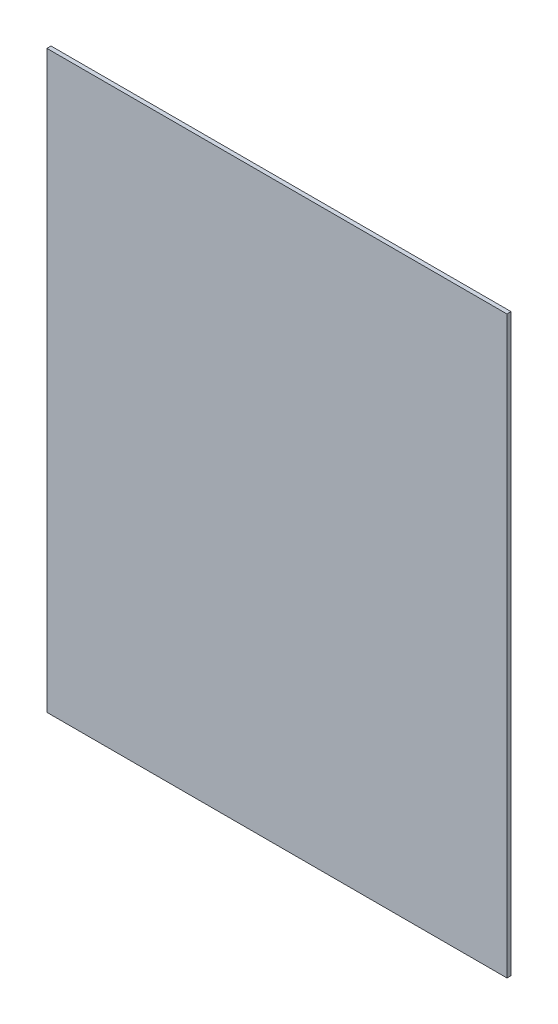
ISO-10303-21;
HEADER;
FILE_DESCRIPTION(('STEP AP214'),'2;1');
FILE_NAME('part.step','',(''),(''),'','','');
FILE_SCHEMA(('AUTOMOTIVE_DESIGN { 1 0 10303 214 1 1 1 1 }'));
ENDSEC;
DATA;
#1=APPLICATION_CONTEXT('core data for automotive mechanical design processes');
#2=APPLICATION_PROTOCOL_DEFINITION('international standard','automotive_design',2000,#1);
#3=PRODUCT_CONTEXT('',#1,'mechanical');
#4=PRODUCT('Part','Part','',(#3));
#5=PRODUCT_RELATED_PRODUCT_CATEGORY('part','',(#4));
#6=PRODUCT_DEFINITION_FORMATION('','',#4);
#7=PRODUCT_DEFINITION_CONTEXT('part definition',#1,'design');
#8=PRODUCT_DEFINITION('design','',#6,#7);
#9=PRODUCT_DEFINITION_SHAPE('','',#8);
#10=(LENGTH_UNIT() NAMED_UNIT(*) SI_UNIT(.MILLI.,.METRE.));
#11=(NAMED_UNIT(*) PLANE_ANGLE_UNIT() SI_UNIT($,.RADIAN.));
#12=(NAMED_UNIT(*) SI_UNIT($,.STERADIAN.) SOLID_ANGLE_UNIT());
#13=UNCERTAINTY_MEASURE_WITH_UNIT(LENGTH_MEASURE(1.E-05),#10,'distance_accuracy_value','');
#14=(GEOMETRIC_REPRESENTATION_CONTEXT(3) GLOBAL_UNCERTAINTY_ASSIGNED_CONTEXT((#13)) GLOBAL_UNIT_ASSIGNED_CONTEXT((#10,
#11,#12)) REPRESENTATION_CONTEXT('',''));
#15=CARTESIAN_POINT('',(0.,0.,0.));
#16=DIRECTION('',(0.,0.,1.));
#17=DIRECTION('',(1.,0.,0.));
#18=AXIS2_PLACEMENT_3D('',#15,#16,#17);
#19=CARTESIAN_POINT('',(0.,68.,-2.8421709430404E-13));
#20=DIRECTION('',(0.,0.,1.));
#21=DIRECTION('',(1.,0.,0.));
#22=AXIS2_PLACEMENT_3D('',#19,#20,#21);
#23=PLANE('',#22);
#24=DIRECTION('',(0.,1.,0.));
#25=VECTOR('',#24,1.);
#26=CARTESIAN_POINT('',(-275.,243.,-2.8421709430404E-13));
#27=LINE('',#26,#25);
#28=CARTESIAN_POINT('',(-275.,-282.,-2.8421709430404E-13));
#29=VERTEX_POINT('',#28);
#30=CARTESIAN_POINT('',(-275.,418.,-2.8421709430404E-13));
#31=VERTEX_POINT('',#30);
#32=EDGE_CURVE('E11',#29,#31,#27,.T.);
#33=ORIENTED_EDGE('',*,*,#32,.T.);
#34=DIRECTION('',(-1.,0.,0.));
#35=VECTOR('',#34,1.);
#36=CARTESIAN_POINT('',(285.,418.,-2.8421709430404E-13));
#37=LINE('',#36,#35);
#38=CARTESIAN_POINT('',(285.,418.,-2.8421709430404E-13));
#39=VERTEX_POINT('',#38);
#40=EDGE_CURVE('E24',#39,#31,#37,.T.);
#41=ORIENTED_EDGE('',*,*,#40,.F.);
#42=DIRECTION('',(0.,1.,0.));
#43=VECTOR('',#42,1.);
#44=CARTESIAN_POINT('',(285.,-282.,-2.8421709430404E-13));
#45=LINE('',#44,#43);
#46=CARTESIAN_POINT('',(285.,-282.,-2.8421709430404E-13));
#47=VERTEX_POINT('',#46);
#48=EDGE_CURVE('E100',#47,#39,#45,.T.);
#49=ORIENTED_EDGE('',*,*,#48,.F.);
#50=DIRECTION('',(1.,0.,0.));
#51=VECTOR('',#50,1.);
#52=CARTESIAN_POINT('',(-285.,-282.,-2.8421709430404E-13));
#53=LINE('',#52,#51);
#54=EDGE_CURVE('E96',#29,#47,#53,.T.);
#55=ORIENTED_EDGE('',*,*,#54,.F.);
#56=EDGE_LOOP('',(#33,#41,#49,#55));
#57=FACE_BOUND('',#56,.T.);
#58=ADVANCED_FACE('F16',(#57),#23,.F.);
#59=CARTESIAN_POINT('',(285.,-282.,-2.8421709430404E-13));
#60=DIRECTION('',(1.,0.,0.));
#61=DIRECTION('',(0.,1.,0.));
#62=AXIS2_PLACEMENT_3D('',#59,#60,#61);
#63=PLANE('',#62);
#64=ORIENTED_EDGE('',*,*,#48,.T.);
#65=DIRECTION('',(0.,0.,1.));
#66=VECTOR('',#65,1.);
#67=CARTESIAN_POINT('',(285.,418.,-2.8421709430404E-13));
#68=LINE('',#67,#66);
#69=CARTESIAN_POINT('',(285.,418.,4.99999999999972));
#70=VERTEX_POINT('',#69);
#71=EDGE_CURVE('E92',#39,#70,#68,.T.);
#72=ORIENTED_EDGE('',*,*,#71,.T.);
#73=DIRECTION('',(0.,1.,0.));
#74=VECTOR('',#73,1.);
#75=CARTESIAN_POINT('',(285.,-282.,4.99999999999972));
#76=LINE('',#75,#74);
#77=CARTESIAN_POINT('',(285.,-282.,4.99999999999972));
#78=VERTEX_POINT('',#77);
#79=EDGE_CURVE('E88',#78,#70,#76,.T.);
#80=ORIENTED_EDGE('',*,*,#79,.F.);
#81=DIRECTION('',(0.,0.,1.));
#82=VECTOR('',#81,1.);
#83=CARTESIAN_POINT('',(285.,-282.,-2.8421709430404E-13));
#84=LINE('',#83,#82);
#85=EDGE_CURVE('E60',#47,#78,#84,.T.);
#86=ORIENTED_EDGE('',*,*,#85,.F.);
#87=EDGE_LOOP('',(#64,#72,#80,#86));
#88=FACE_BOUND('',#87,.T.);
#89=ADVANCED_FACE('F112',(#88),#63,.T.);
#90=CARTESIAN_POINT('',(285.,418.,-2.8421709430404E-13));
#91=DIRECTION('',(0.,1.,0.));
#92=DIRECTION('',(-1.,0.,0.));
#93=AXIS2_PLACEMENT_3D('',#90,#91,#92);
#94=PLANE('',#93);
#95=DIRECTION('',(0.,0.,1.));
#96=VECTOR('',#95,1.);
#97=CARTESIAN_POINT('',(-275.,418.,-2.8421709430404E-13));
#98=LINE('',#97,#96);
#99=CARTESIAN_POINT('',(-275.,418.,4.99999999999972));
#100=VERTEX_POINT('',#99);
#101=EDGE_CURVE('E75',#31,#100,#98,.T.);
#102=ORIENTED_EDGE('',*,*,#101,.T.);
#103=DIRECTION('',(-1.,0.,0.));
#104=VECTOR('',#103,1.);
#105=CARTESIAN_POINT('',(285.,418.,4.99999999999972));
#106=LINE('',#105,#104);
#107=EDGE_CURVE('E69',#70,#100,#106,.T.);
#108=ORIENTED_EDGE('',*,*,#107,.F.);
#109=ORIENTED_EDGE('',*,*,#71,.F.);
#110=ORIENTED_EDGE('',*,*,#40,.T.);
#111=EDGE_LOOP('',(#102,#108,#109,#110));
#112=FACE_BOUND('',#111,.T.);
#113=ADVANCED_FACE('F110',(#112),#94,.T.);
#114=CARTESIAN_POINT('',(-285.,-282.,-2.8421709430404E-13));
#115=DIRECTION('',(0.,-1.,0.));
#116=DIRECTION('',(1.,0.,0.));
#117=AXIS2_PLACEMENT_3D('',#114,#115,#116);
#118=PLANE('',#117);
#119=DIRECTION('',(0.,0.,-1.));
#120=VECTOR('',#119,1.);
#121=CARTESIAN_POINT('',(-275.,-282.,-2.8421709430404E-13));
#122=LINE('',#121,#120);
#123=CARTESIAN_POINT('',(-275.,-282.,4.99999999999972));
#124=VERTEX_POINT('',#123);
#125=EDGE_CURVE('E58',#124,#29,#122,.T.);
#126=ORIENTED_EDGE('',*,*,#125,.T.);
#127=ORIENTED_EDGE('',*,*,#54,.T.);
#128=ORIENTED_EDGE('',*,*,#85,.T.);
#129=DIRECTION('',(1.,0.,0.));
#130=VECTOR('',#129,1.);
#131=CARTESIAN_POINT('',(-285.,-282.,4.99999999999972));
#132=LINE('',#131,#130);
#133=EDGE_CURVE('E53',#124,#78,#132,.T.);
#134=ORIENTED_EDGE('',*,*,#133,.F.);
#135=EDGE_LOOP('',(#126,#127,#128,#134));
#136=FACE_BOUND('',#135,.T.);
#137=ADVANCED_FACE('F55',(#136),#118,.T.);
#138=CARTESIAN_POINT('',(0.,68.,4.99999999999972));
#139=DIRECTION('',(0.,0.,1.));
#140=DIRECTION('',(1.,0.,0.));
#141=AXIS2_PLACEMENT_3D('',#138,#139,#140);
#142=PLANE('',#141);
#143=DIRECTION('',(0.,-1.,0.));
#144=VECTOR('',#143,1.);
#145=CARTESIAN_POINT('',(-275.,243.,4.99999999999972));
#146=LINE('',#145,#144);
#147=EDGE_CURVE('E63',#100,#124,#146,.T.);
#148=ORIENTED_EDGE('',*,*,#147,.T.);
#149=ORIENTED_EDGE('',*,*,#133,.T.);
#150=ORIENTED_EDGE('',*,*,#79,.T.);
#151=ORIENTED_EDGE('',*,*,#107,.T.);
#152=EDGE_LOOP('',(#148,#149,#150,#151));
#153=FACE_BOUND('',#152,.T.);
#154=ADVANCED_FACE('F67',(#153),#142,.T.);
#155=CARTESIAN_POINT('',(-275.,418.,-2.8421709430404E-13));
#156=DIRECTION('',(1.,0.,0.));
#157=DIRECTION('',(0.,0.,-1.));
#158=AXIS2_PLACEMENT_3D('',#155,#156,#157);
#159=PLANE('',#158);
#160=ORIENTED_EDGE('',*,*,#32,.F.);
#161=ORIENTED_EDGE('',*,*,#125,.F.);
#162=ORIENTED_EDGE('',*,*,#147,.F.);
#163=ORIENTED_EDGE('',*,*,#101,.F.);
#164=EDGE_LOOP('',(#160,#161,#162,#163));
#165=FACE_BOUND('',#164,.T.);
#166=ADVANCED_FACE('F73',(#165),#159,.F.);
#167=CLOSED_SHELL('',(#58,#89,#113,#137,#154,#166));
#168=MANIFOLD_SOLID_BREP('B1',#167);
#169=ADVANCED_BREP_SHAPE_REPRESENTATION('',(#18,#168),#14);
#170=SHAPE_DEFINITION_REPRESENTATION(#9,#169);
ENDSEC;
END-ISO-10303-21;
